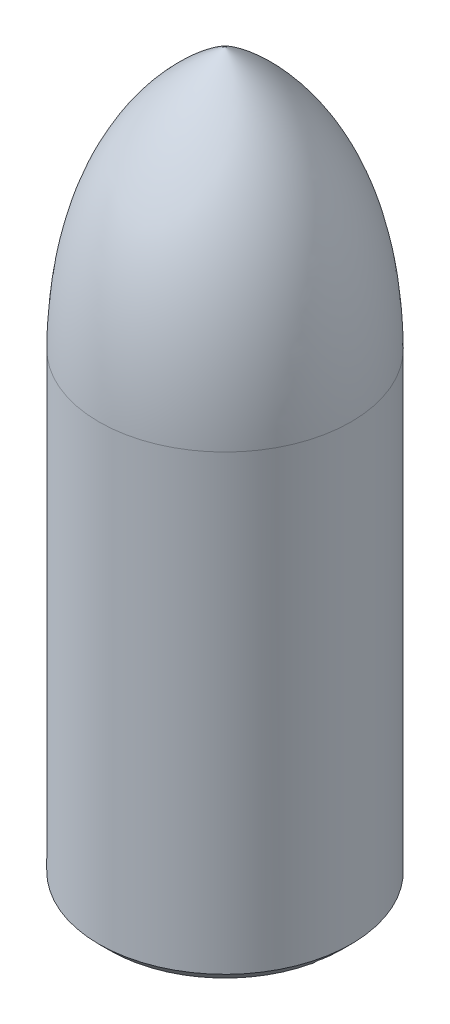
ISO-10303-21;
HEADER;
FILE_DESCRIPTION(('STEP AP214'),'2;1');
FILE_NAME('part.step','',(''),(''),'','','');
FILE_SCHEMA(('AUTOMOTIVE_DESIGN { 1 0 10303 214 1 1 1 1 }'));
ENDSEC;
DATA;
#1=APPLICATION_CONTEXT('core data for automotive mechanical design processes');
#2=APPLICATION_PROTOCOL_DEFINITION('international standard','automotive_design',2000,#1);
#3=PRODUCT_CONTEXT('',#1,'mechanical');
#4=PRODUCT('Part','Part','',(#3));
#5=PRODUCT_RELATED_PRODUCT_CATEGORY('part','',(#4));
#6=PRODUCT_DEFINITION_FORMATION('','',#4);
#7=PRODUCT_DEFINITION_CONTEXT('part definition',#1,'design');
#8=PRODUCT_DEFINITION('design','',#6,#7);
#9=PRODUCT_DEFINITION_SHAPE('','',#8);
#10=(LENGTH_UNIT() NAMED_UNIT(*) SI_UNIT(.MILLI.,.METRE.));
#11=(NAMED_UNIT(*) PLANE_ANGLE_UNIT() SI_UNIT($,.RADIAN.));
#12=(NAMED_UNIT(*) SI_UNIT($,.STERADIAN.) SOLID_ANGLE_UNIT());
#13=UNCERTAINTY_MEASURE_WITH_UNIT(LENGTH_MEASURE(1.E-05),#10,'distance_accuracy_value','');
#14=(GEOMETRIC_REPRESENTATION_CONTEXT(3) GLOBAL_UNCERTAINTY_ASSIGNED_CONTEXT((#13)) GLOBAL_UNIT_ASSIGNED_CONTEXT((#10,
#11,#12)) REPRESENTATION_CONTEXT('',''));
#15=CARTESIAN_POINT('',(0.,0.,0.));
#16=DIRECTION('',(0.,0.,1.));
#17=DIRECTION('',(1.,0.,0.));
#18=AXIS2_PLACEMENT_3D('',#15,#16,#17);
#19=CARTESIAN_POINT('',(0.,0.,0.));
#20=DIRECTION('',(0.,1.,0.));
#21=DIRECTION('',(0.,0.,1.));
#22=AXIS2_PLACEMENT_3D('',#19,#20,#21);
#23=PLANE('',#22);
#24=DIRECTION('',(-1.,0.,0.));
#25=VECTOR('',#24,1.);
#26=CARTESIAN_POINT('',(0.,0.,6.5));
#27=LINE('',#26,#25);
#28=CARTESIAN_POINT('',(30.3108891324553,0.,6.5));
#29=VERTEX_POINT('',#28);
#30=CARTESIAN_POINT('',(25.6904651573303,0.,6.5));
#31=VERTEX_POINT('',#30);
#32=EDGE_CURVE('E244',#29,#31,#27,.T.);
#33=ORIENTED_EDGE('',*,*,#32,.F.);
#34=CARTESIAN_POINT('',(0.,0.,0.));
#35=DIRECTION('',(0.,1.,0.));
#36=DIRECTION('',(0.,0.,1.));
#37=AXIS2_PLACEMENT_3D('',#34,#35,#36);
#38=CIRCLE('',#37,31.);
#39=CARTESIAN_POINT('',(-30.3108891324553,0.,6.5));
#40=VERTEX_POINT('',#39);
#41=EDGE_CURVE('E180',#29,#40,#38,.F.);
#42=ORIENTED_EDGE('',*,*,#41,.T.);
#43=CARTESIAN_POINT('',(-25.6904651573303,0.,6.5));
#44=VERTEX_POINT('',#43);
#45=EDGE_CURVE('E173',#44,#40,#27,.T.);
#46=ORIENTED_EDGE('',*,*,#45,.F.);
#47=CARTESIAN_POINT('',(0.,0.,0.));
#48=DIRECTION('',(0.,1.,0.));
#49=DIRECTION('',(0.,0.,1.));
#50=AXIS2_PLACEMENT_3D('',#47,#48,#49);
#51=CIRCLE('',#50,26.5);
#52=EDGE_CURVE('E245',#44,#31,#51,.T.);
#53=ORIENTED_EDGE('',*,*,#52,.T.);
#54=EDGE_LOOP('',(#33,#42,#46,#53));
#55=FACE_BOUND('',#54,.T.);
#56=ADVANCED_FACE('F40',(#55),#23,.F.);
#57=CARTESIAN_POINT('',(0.,125.,0.));
#58=DIRECTION('',(0.,-1.,0.));
#59=DIRECTION('',(0.,0.,-1.));
#60=AXIS2_PLACEMENT_3D('',#57,#58,#59);
#61=CYLINDRICAL_SURFACE('',#60,26.5);
#62=CARTESIAN_POINT('',(25.6904651573303,0.,-6.5));
#63=VERTEX_POINT('',#62);
#64=CARTESIAN_POINT('',(-25.6904651573303,0.,-6.5));
#65=VERTEX_POINT('',#64);
#66=EDGE_CURVE('E169',#63,#65,#51,.T.);
#67=ORIENTED_EDGE('',*,*,#66,.F.);
#68=DIRECTION('',(0.,-1.,0.));
#69=VECTOR('',#68,1.);
#70=CARTESIAN_POINT('',(25.6904651573303,125.,-6.5));
#71=LINE('',#70,#69);
#72=CARTESIAN_POINT('',(25.6904651573303,125.,-6.5));
#73=VERTEX_POINT('',#72);
#74=EDGE_CURVE('E187',#73,#63,#71,.T.);
#75=ORIENTED_EDGE('',*,*,#74,.F.);
#76=CARTESIAN_POINT('',(0.,125.,0.));
#77=DIRECTION('',(0.,1.,0.));
#78=DIRECTION('',(0.,0.,1.));
#79=AXIS2_PLACEMENT_3D('',#76,#77,#78);
#80=CIRCLE('',#79,26.5);
#81=CARTESIAN_POINT('',(-25.6904651573303,125.,-6.5));
#82=VERTEX_POINT('',#81);
#83=EDGE_CURVE('E172',#73,#82,#80,.T.);
#84=ORIENTED_EDGE('',*,*,#83,.T.);
#85=DIRECTION('',(0.,-1.,0.));
#86=VECTOR('',#85,1.);
#87=CARTESIAN_POINT('',(-25.6904651573303,125.,-6.5));
#88=LINE('',#87,#86);
#89=EDGE_CURVE('E250',#82,#65,#88,.T.);
#90=ORIENTED_EDGE('',*,*,#89,.T.);
#91=EDGE_LOOP('',(#67,#75,#84,#90));
#92=FACE_BOUND('',#91,.T.);
#93=ADVANCED_FACE('F142',(#92),#61,.F.);
#94=CARTESIAN_POINT('',(0.,125.,-6.5));
#95=DIRECTION('',(0.,0.,1.));
#96=DIRECTION('',(1.,0.,0.));
#97=AXIS2_PLACEMENT_3D('',#94,#95,#96);
#98=PLANE('',#97);
#99=DIRECTION('',(-1.,0.,0.));
#100=VECTOR('',#99,1.);
#101=CARTESIAN_POINT('',(0.,0.,-6.5));
#102=LINE('',#101,#100);
#103=CARTESIAN_POINT('',(30.3108891324553,0.,-6.5));
#104=VERTEX_POINT('',#103);
#105=EDGE_CURVE('E175',#104,#63,#102,.T.);
#106=ORIENTED_EDGE('',*,*,#105,.F.);
#107=CARTESIAN_POINT('',(30.3108891324553,0.,-6.5));
#108=CARTESIAN_POINT('',(30.5091533088091,0.193859917591633,-6.5));
#109=CARTESIAN_POINT('',(30.7073779693572,0.387760215807544,-6.5));
#110=CARTESIAN_POINT('',(31.1037482585386,0.775641573191266,-6.5));
#111=CARTESIAN_POINT('',(31.3018938871721,0.969622632358953,-6.5));
#112=CARTESIAN_POINT('',(31.5,1.16364407215079,-6.5));
#113=B_SPLINE_CURVE_WITH_KNOTS('',3,(#107,#108,#109,#110,#111,#112),.UNSPECIFIED.,.F.,.F.,(4,2,
4),(0.,0.831873232697449,1.66374646412243),.UNSPECIFIED.);
#114=CARTESIAN_POINT('',(31.5,1.16364407215079,-6.5));
#115=VERTEX_POINT('',#114);
#116=EDGE_CURVE('E69',#104,#115,#113,.T.);
#117=ORIENTED_EDGE('',*,*,#116,.T.);
#118=DIRECTION('',(0.,-1.,0.));
#119=VECTOR('',#118,1.);
#120=CARTESIAN_POINT('',(31.5,125.,-6.5));
#121=LINE('',#120,#119);
#122=CARTESIAN_POINT('',(31.5,125.,-6.5));
#123=VERTEX_POINT('',#122);
#124=EDGE_CURVE('E265',#123,#115,#121,.T.);
#125=ORIENTED_EDGE('',*,*,#124,.F.);
#126=DIRECTION('',(-1.,0.,0.));
#127=VECTOR('',#126,1.);
#128=CARTESIAN_POINT('',(0.,125.,-6.5));
#129=LINE('',#128,#127);
#130=EDGE_CURVE('E289',#123,#73,#129,.T.);
#131=ORIENTED_EDGE('',*,*,#130,.T.);
#132=ORIENTED_EDGE('',*,*,#74,.T.);
#133=EDGE_LOOP('',(#106,#117,#125,#131,#132));
#134=FACE_BOUND('',#133,.T.);
#135=ADVANCED_FACE('F148',(#134),#98,.T.);
#136=CARTESIAN_POINT('',(31.5,125.,0.));
#137=DIRECTION('',(-1.,0.,0.));
#138=DIRECTION('',(0.,0.,1.));
#139=AXIS2_PLACEMENT_3D('',#136,#137,#138);
#140=PLANE('',#139);
#141=ORIENTED_EDGE('',*,*,#124,.T.);
#142=CARTESIAN_POINT('',(31.5,1.1636440721508,-6.5));
#143=CARTESIAN_POINT('',(31.5,1.08420707752169,-6.10701070302974));
#144=CARTESIAN_POINT('',(31.5,1.01143658593983,-5.71265726925495));
#145=CARTESIAN_POINT('',(31.5,0.879779060000657,-4.9216004227788));
#146=CARTESIAN_POINT('',(31.5,0.820893466840817,-4.52489677051108));
#147=CARTESIAN_POINT('',(31.5,0.71754943507013,-3.72941885557227));
#148=CARTESIAN_POINT('',(31.5,0.673097562649845,-3.33064373412382));
#149=CARTESIAN_POINT('',(31.5,0.59907356887062,-2.53174824245829));
#150=CARTESIAN_POINT('',(31.5,0.569500828141865,-2.13162792893528));
#151=CARTESIAN_POINT('',(31.5,0.504234490194832,-0.941773627315787));
#152=CARTESIAN_POINT('',(31.5,0.490446952188602,-0.150725638104659));
#153=CARTESIAN_POINT('',(31.5,0.522535682788784,1.42978022317585));
#154=CARTESIAN_POINT('',(31.5,0.568383120127251,2.2192386789625));
#155=CARTESIAN_POINT('',(31.5,0.670854908832734,3.29819754395972));
#156=CARTESIAN_POINT('',(31.5,0.702617159457006,3.59023045669179));
#157=CARTESIAN_POINT('',(31.5,0.773935416085597,4.17332072155011));
#158=CARTESIAN_POINT('',(31.5,0.813490491668651,4.46437818592462));
#159=CARTESIAN_POINT('',(31.5,0.900445985611464,5.04696789881321));
#160=CARTESIAN_POINT('',(31.5,0.947888812171919,5.33849378543313));
#161=CARTESIAN_POINT('',(31.5,1.05023214799722,5.92025776368064));
#162=CARTESIAN_POINT('',(31.5,1.10513323555274,6.21049575364485));
#163=CARTESIAN_POINT('',(31.5,1.16364407215079,6.5));
#164=B_SPLINE_CURVE_WITH_KNOTS('',3,(#142,#143,#144,#145,#146,#147,#148,#149,#150,#151,#152,
#153,#154,#155,#156,#157,#158,#159,#160,#161,#162,#163),.UNSPECIFIED.,.F.,.F.,(4,2,2,2,2,2,2,2,
2,2,4),(0.,1.20277759631695,2.40567998128389,3.60912882660717,4.81252757212713,7.18365267057173,
9.5536318451717,10.434823759662,11.3159105282812,12.2018974343716,13.087953076418),.UNSPECIFIED.);
#165=CARTESIAN_POINT('',(31.5,1.16364407215079,6.5));
#166=VERTEX_POINT('',#165);
#167=EDGE_CURVE('E55',#115,#166,#164,.T.);
#168=ORIENTED_EDGE('',*,*,#167,.T.);
#169=DIRECTION('',(0.,-1.,0.));
#170=VECTOR('',#169,1.);
#171=CARTESIAN_POINT('',(31.5,125.,6.5));
#172=LINE('',#171,#170);
#173=CARTESIAN_POINT('',(31.5,125.,6.5));
#174=VERTEX_POINT('',#173);
#175=EDGE_CURVE('E263',#174,#166,#172,.T.);
#176=ORIENTED_EDGE('',*,*,#175,.F.);
#177=DIRECTION('',(0.,0.,-1.));
#178=VECTOR('',#177,1.);
#179=CARTESIAN_POINT('',(31.5,125.,0.));
#180=LINE('',#179,#178);
#181=EDGE_CURVE('E267',#174,#123,#180,.T.);
#182=ORIENTED_EDGE('',*,*,#181,.T.);
#183=EDGE_LOOP('',(#141,#168,#176,#182));
#184=FACE_BOUND('',#183,.T.);
#185=ADVANCED_FACE('F214',(#184),#140,.T.);
#186=CARTESIAN_POINT('',(0.,125.,6.5));
#187=DIRECTION('',(0.,0.,1.));
#188=DIRECTION('',(1.,0.,0.));
#189=AXIS2_PLACEMENT_3D('',#186,#187,#188);
#190=PLANE('',#189);
#191=ORIENTED_EDGE('',*,*,#175,.T.);
#192=CARTESIAN_POINT('',(31.5,1.1636440721508,6.5));
#193=CARTESIAN_POINT('',(31.3018938871721,0.969622632358951,6.5));
#194=CARTESIAN_POINT('',(31.1037482585386,0.775641573191263,6.5));
#195=CARTESIAN_POINT('',(30.7073779693572,0.387760215807542,6.5));
#196=CARTESIAN_POINT('',(30.5091533088091,0.193859917591631,6.5));
#197=CARTESIAN_POINT('',(30.3108891324553,0.,6.5));
#198=B_SPLINE_CURVE_WITH_KNOTS('',3,(#192,#193,#194,#195,#196,#197),.UNSPECIFIED.,.F.,.F.,(4,2,
4),(0.,0.831873231424982,1.66374646412243),.UNSPECIFIED.);
#199=EDGE_CURVE('E11',#166,#29,#198,.T.);
#200=ORIENTED_EDGE('',*,*,#199,.T.);
#201=ORIENTED_EDGE('',*,*,#32,.T.);
#202=DIRECTION('',(0.,-1.,0.));
#203=VECTOR('',#202,1.);
#204=CARTESIAN_POINT('',(25.6904651573303,125.,6.5));
#205=LINE('',#204,#203);
#206=CARTESIAN_POINT('',(25.6904651573303,125.,6.5));
#207=VERTEX_POINT('',#206);
#208=EDGE_CURVE('E260',#207,#31,#205,.T.);
#209=ORIENTED_EDGE('',*,*,#208,.F.);
#210=DIRECTION('',(-1.,0.,0.));
#211=VECTOR('',#210,1.);
#212=CARTESIAN_POINT('',(0.,125.,6.5));
#213=LINE('',#212,#211);
#214=EDGE_CURVE('E283',#174,#207,#213,.T.);
#215=ORIENTED_EDGE('',*,*,#214,.F.);
#216=EDGE_LOOP('',(#191,#200,#201,#209,#215));
#217=FACE_BOUND('',#216,.T.);
#218=ADVANCED_FACE('F208',(#217),#190,.F.);
#219=ORIENTED_EDGE('',*,*,#52,.F.);
#220=DIRECTION('',(0.,-1.,0.));
#221=VECTOR('',#220,1.);
#222=CARTESIAN_POINT('',(-25.6904651573303,125.,6.5));
#223=LINE('',#222,#221);
#224=CARTESIAN_POINT('',(-25.6904651573303,125.,6.5));
#225=VERTEX_POINT('',#224);
#226=EDGE_CURVE('E258',#225,#44,#223,.T.);
#227=ORIENTED_EDGE('',*,*,#226,.F.);
#228=EDGE_CURVE('E282',#225,#207,#80,.T.);
#229=ORIENTED_EDGE('',*,*,#228,.T.);
#230=ORIENTED_EDGE('',*,*,#208,.T.);
#231=EDGE_LOOP('',(#219,#227,#229,#230));
#232=FACE_BOUND('',#231,.T.);
#233=ADVANCED_FACE('F151',(#232),#61,.F.);
#234=ORIENTED_EDGE('',*,*,#45,.T.);
#235=CARTESIAN_POINT('',(-30.3108891324553,0.,6.5));
#236=CARTESIAN_POINT('',(-30.5091533088092,0.193859917591637,6.5));
#237=CARTESIAN_POINT('',(-30.7073779693572,0.387760215807553,6.5));
#238=CARTESIAN_POINT('',(-31.1037482585386,0.775641573191284,6.5));
#239=CARTESIAN_POINT('',(-31.3018938871722,0.969622632358975,6.5));
#240=CARTESIAN_POINT('',(-31.5,1.16364407215082,6.5));
#241=B_SPLINE_CURVE_WITH_KNOTS('',3,(#235,#236,#237,#238,#239,#240),.UNSPECIFIED.,.F.,.F.,(4,2,
4),(0.,0.831873232697466,1.66374646412246),.UNSPECIFIED.);
#242=CARTESIAN_POINT('',(-31.5,1.16364407215082,6.5));
#243=VERTEX_POINT('',#242);
#244=EDGE_CURVE('E184',#40,#243,#241,.T.);
#245=ORIENTED_EDGE('',*,*,#244,.T.);
#246=DIRECTION('',(0.,-1.,0.));
#247=VECTOR('',#246,1.);
#248=CARTESIAN_POINT('',(-31.5,125.,6.5));
#249=LINE('',#248,#247);
#250=CARTESIAN_POINT('',(-31.5,125.,6.5));
#251=VERTEX_POINT('',#250);
#252=EDGE_CURVE('E255',#251,#243,#249,.T.);
#253=ORIENTED_EDGE('',*,*,#252,.F.);
#254=EDGE_CURVE('E280',#225,#251,#213,.T.);
#255=ORIENTED_EDGE('',*,*,#254,.F.);
#256=ORIENTED_EDGE('',*,*,#226,.T.);
#257=EDGE_LOOP('',(#234,#245,#253,#255,#256));
#258=FACE_BOUND('',#257,.T.);
#259=ADVANCED_FACE('F203',(#258),#190,.F.);
#260=CARTESIAN_POINT('',(-31.5,125.,0.));
#261=DIRECTION('',(-1.,0.,0.));
#262=DIRECTION('',(0.,0.,1.));
#263=AXIS2_PLACEMENT_3D('',#260,#261,#262);
#264=PLANE('',#263);
#265=ORIENTED_EDGE('',*,*,#252,.T.);
#266=CARTESIAN_POINT('',(-31.5,1.16364407215082,6.5));
#267=CARTESIAN_POINT('',(-31.5,1.08420707752172,6.10701070302974));
#268=CARTESIAN_POINT('',(-31.5,1.01143658593986,5.71265726925494));
#269=CARTESIAN_POINT('',(-31.5,0.879779060000682,4.9216004227788));
#270=CARTESIAN_POINT('',(-31.5,0.820893466840837,4.52489677051108));
#271=CARTESIAN_POINT('',(-31.5,0.717549435070151,3.72941885557227));
#272=CARTESIAN_POINT('',(-31.5,0.673097562649872,3.33064373412382));
#273=CARTESIAN_POINT('',(-31.5,0.599073568870649,2.53174824245828));
#274=CARTESIAN_POINT('',(-31.5,0.569500828141888,2.13162792893527));
#275=CARTESIAN_POINT('',(-31.5,0.504234490194849,0.941773627315784));
#276=CARTESIAN_POINT('',(-31.5,0.490446952188626,0.150725638104656));
#277=CARTESIAN_POINT('',(-31.5,0.522535682788815,-1.42978022317586));
#278=CARTESIAN_POINT('',(-31.5,0.568383120127279,-2.2192386789625));
#279=CARTESIAN_POINT('',(-31.5,0.670854908832762,-3.29819754395973));
#280=CARTESIAN_POINT('',(-31.5,0.702617159457034,-3.59023045669179));
#281=CARTESIAN_POINT('',(-31.5,0.773935416085625,-4.17332072155012));
#282=CARTESIAN_POINT('',(-31.5,0.813490491668679,-4.46437818592463));
#283=CARTESIAN_POINT('',(-31.5,0.900445985611492,-5.04696789881321));
#284=CARTESIAN_POINT('',(-31.5,0.947888812171946,-5.33849378543314));
#285=CARTESIAN_POINT('',(-31.5,1.05023214799725,-5.92025776368064));
#286=CARTESIAN_POINT('',(-31.5,1.10513323555277,-6.21049575364485));
#287=CARTESIAN_POINT('',(-31.5,1.16364407215082,-6.5));
#288=B_SPLINE_CURVE_WITH_KNOTS('',3,(#266,#267,#268,#269,#270,#271,#272,#273,#274,#275,#276,
#277,#278,#279,#280,#281,#282,#283,#284,#285,#286,#287),.UNSPECIFIED.,.F.,.F.,(4,2,2,2,2,2,2,2,
2,2,4),(0.,1.20277759631695,2.40567998128389,3.60912882660718,4.81252757212713,7.18365267057174,
9.5536318451717,10.434823759662,11.3159105282812,12.2018974343716,13.087953076418),.UNSPECIFIED.);
#289=CARTESIAN_POINT('',(-31.5,1.16364407215082,-6.5));
#290=VERTEX_POINT('',#289);
#291=EDGE_CURVE('E196',#243,#290,#288,.T.);
#292=ORIENTED_EDGE('',*,*,#291,.T.);
#293=DIRECTION('',(0.,-1.,0.));
#294=VECTOR('',#293,1.);
#295=CARTESIAN_POINT('',(-31.5,125.,-6.5));
#296=LINE('',#295,#294);
#297=CARTESIAN_POINT('',(-31.5,125.,-6.5));
#298=VERTEX_POINT('',#297);
#299=EDGE_CURVE('E252',#298,#290,#296,.T.);
#300=ORIENTED_EDGE('',*,*,#299,.F.);
#301=DIRECTION('',(0.,0.,-1.));
#302=VECTOR('',#301,1.);
#303=CARTESIAN_POINT('',(-31.5,125.,0.));
#304=LINE('',#303,#302);
#305=EDGE_CURVE('E285',#251,#298,#304,.T.);
#306=ORIENTED_EDGE('',*,*,#305,.F.);
#307=EDGE_LOOP('',(#265,#292,#300,#306));
#308=FACE_BOUND('',#307,.T.);
#309=ADVANCED_FACE('F206',(#308),#264,.F.);
#310=ORIENTED_EDGE('',*,*,#299,.T.);
#311=CARTESIAN_POINT('',(-31.5,1.16364407215082,-6.5));
#312=CARTESIAN_POINT('',(-31.3018938871722,0.969622632358974,-6.5));
#313=CARTESIAN_POINT('',(-31.1037482585386,0.775641573191282,-6.5));
#314=CARTESIAN_POINT('',(-30.7073779693572,0.387760215807551,-6.5));
#315=CARTESIAN_POINT('',(-30.5091533088091,0.193859917591636,-6.5));
#316=CARTESIAN_POINT('',(-30.3108891324553,0.,-6.5));
#317=B_SPLINE_CURVE_WITH_KNOTS('',3,(#311,#312,#313,#314,#315,#316),.UNSPECIFIED.,.F.,.F.,(4,2,
4),(0.,0.831873231425001,1.66374646412247),.UNSPECIFIED.);
#318=CARTESIAN_POINT('',(-30.3108891324553,0.,-6.5));
#319=VERTEX_POINT('',#318);
#320=EDGE_CURVE('E179',#290,#319,#317,.T.);
#321=ORIENTED_EDGE('',*,*,#320,.T.);
#322=EDGE_CURVE('E165',#65,#319,#102,.T.);
#323=ORIENTED_EDGE('',*,*,#322,.F.);
#324=ORIENTED_EDGE('',*,*,#89,.F.);
#325=EDGE_CURVE('E290',#82,#298,#129,.T.);
#326=ORIENTED_EDGE('',*,*,#325,.T.);
#327=EDGE_LOOP('',(#310,#321,#323,#324,#326));
#328=FACE_BOUND('',#327,.T.);
#329=ADVANCED_FACE('F160',(#328),#98,.T.);
#330=CARTESIAN_POINT('',(0.,125.,0.));
#331=DIRECTION('',(0.,-1.,0.));
#332=DIRECTION('',(0.,0.,-1.));
#333=AXIS2_PLACEMENT_3D('',#330,#331,#332);
#334=CYLINDRICAL_SURFACE('',#333,34.);
#335=CARTESIAN_POINT('',(0.,3.00000000000003,0.));
#336=DIRECTION('',(0.,1.,0.));
#337=DIRECTION('',(0.,0.,1.));
#338=AXIS2_PLACEMENT_3D('',#335,#336,#337);
#339=CIRCLE('',#338,34.);
#340=CARTESIAN_POINT('',(0.,3.00000000000003,34.));
#341=VERTEX_POINT('',#340);
#342=EDGE_CURVE('E181',#341,#341,#339,.T.);
#343=ORIENTED_EDGE('',*,*,#342,.T.);
#344=EDGE_LOOP('',(#343));
#345=FACE_BOUND('',#344,.T.);
#346=CARTESIAN_POINT('',(0.,125.,0.));
#347=DIRECTION('',(0.,1.,0.));
#348=DIRECTION('',(0.,0.,1.));
#349=AXIS2_PLACEMENT_3D('',#346,#347,#348);
#350=CIRCLE('',#349,34.);
#351=CARTESIAN_POINT('',(0.,125.,34.));
#352=VERTEX_POINT('',#351);
#353=EDGE_CURVE('E253',#352,#352,#350,.T.);
#354=ORIENTED_EDGE('',*,*,#353,.F.);
#355=EDGE_LOOP('',(#354));
#356=FACE_BOUND('',#355,.T.);
#357=ADVANCED_FACE('F155',(#345,#356),#334,.T.);
#358=ORIENTED_EDGE('',*,*,#322,.T.);
#359=CARTESIAN_POINT('',(0.,0.,0.));
#360=DIRECTION('',(0.,1.,0.));
#361=DIRECTION('',(0.,0.,1.));
#362=AXIS2_PLACEMENT_3D('',#359,#360,#361);
#363=CIRCLE('',#362,31.);
#364=EDGE_CURVE('E167',#319,#104,#363,.F.);
#365=ORIENTED_EDGE('',*,*,#364,.T.);
#366=ORIENTED_EDGE('',*,*,#105,.T.);
#367=ORIENTED_EDGE('',*,*,#66,.T.);
#368=EDGE_LOOP('',(#358,#365,#366,#367));
#369=FACE_BOUND('',#368,.T.);
#370=ADVANCED_FACE('F136',(#369),#23,.F.);
#371=CARTESIAN_POINT('',(0.,125.,0.));
#372=DIRECTION('',(0.,-1.,0.));
#373=DIRECTION('',(0.,0.,-1.));
#374=AXIS2_PLACEMENT_3D('',#371,#372,#373);
#375=PLANE('',#374);
#376=ORIENTED_EDGE('',*,*,#83,.F.);
#377=ORIENTED_EDGE('',*,*,#130,.F.);
#378=ORIENTED_EDGE('',*,*,#181,.F.);
#379=ORIENTED_EDGE('',*,*,#214,.T.);
#380=ORIENTED_EDGE('',*,*,#228,.F.);
#381=ORIENTED_EDGE('',*,*,#254,.T.);
#382=ORIENTED_EDGE('',*,*,#305,.T.);
#383=ORIENTED_EDGE('',*,*,#325,.F.);
#384=EDGE_LOOP('',(#376,#377,#378,#379,#380,#381,#382,#383));
#385=FACE_BOUND('',#384,.T.);
#386=ADVANCED_FACE('F128',(#385),#375,.T.);
#387=CARTESIAN_POINT('',(0.,195.638896548663,0.));
#388=CARTESIAN_POINT('',(33.4977948943854,174.9907972786,0.));
#389=CARTESIAN_POINT('',(34.,125.,0.));
#390=B_SPLINE_CURVE_WITH_KNOTS('',2,(#387,#388,#389),.UNSPECIFIED.,.F.,.F.,(3,3),(0.,1.),.UNSPECIFIED.);
#391=CARTESIAN_POINT('',(0.,125.,0.));
#392=DIRECTION('',(0.,-1.,0.));
#393=AXIS1_PLACEMENT('',#391,#392);
#394=SURFACE_OF_REVOLUTION('',#390,#393);
#395=ORIENTED_EDGE('',*,*,#353,.T.);
#396=EDGE_LOOP('',(#395));
#397=FACE_BOUND('',#396,.T.);
#398=CARTESIAN_POINT('',(0.,195.638896548663,0.));
#399=VERTEX_POINT('',#398);
#400=VERTEX_LOOP('',#399);
#401=FACE_BOUND('',#400,.T.);
#402=ADVANCED_FACE('F126',(#397,#401),#394,.T.);
#403=CARTESIAN_POINT('',(0.,3.00000000000003,0.));
#404=DIRECTION('',(0.,1.,0.));
#405=DIRECTION('',(0.,0.,1.));
#406=AXIS2_PLACEMENT_3D('',#403,#404,#405);
#407=CONICAL_SURFACE('',#406,34.,0.785398163397448);
#408=ORIENTED_EDGE('',*,*,#244,.F.);
#409=ORIENTED_EDGE('',*,*,#41,.F.);
#410=ORIENTED_EDGE('',*,*,#199,.F.);
#411=ORIENTED_EDGE('',*,*,#167,.F.);
#412=ORIENTED_EDGE('',*,*,#116,.F.);
#413=ORIENTED_EDGE('',*,*,#364,.F.);
#414=ORIENTED_EDGE('',*,*,#320,.F.);
#415=ORIENTED_EDGE('',*,*,#291,.F.);
#416=EDGE_LOOP('',(#408,#409,#410,#411,#412,#413,#414,#415));
#417=FACE_BOUND('',#416,.T.);
#418=ORIENTED_EDGE('',*,*,#342,.F.);
#419=EDGE_LOOP('',(#418));
#420=FACE_BOUND('',#419,.T.);
#421=ADVANCED_FACE('F43',(#417,#420),#407,.T.);
#422=CLOSED_SHELL('',(#56,#93,#135,#185,#218,#233,#259,#309,#329,#357,#370,#386,#402,#421));
#423=MANIFOLD_SOLID_BREP('B2',#422);
#424=ADVANCED_BREP_SHAPE_REPRESENTATION('',(#18,#423),#14);
#425=SHAPE_DEFINITION_REPRESENTATION(#9,#424);
ENDSEC;
END-ISO-10303-21;
